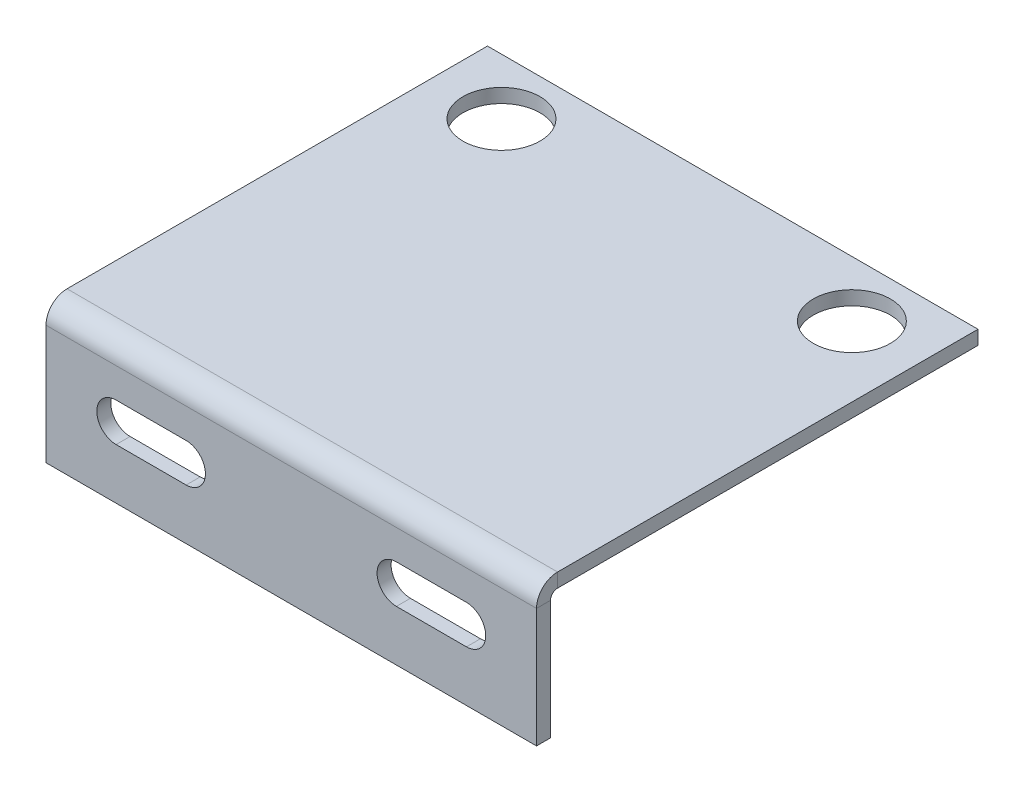
ISO-10303-21;
HEADER;
FILE_DESCRIPTION(('STEP AP214'),'2;1');
FILE_NAME('part.step','',(''),(''),'','','');
FILE_SCHEMA(('AUTOMOTIVE_DESIGN { 1 0 10303 214 1 1 1 1 }'));
ENDSEC;
DATA;
#1=APPLICATION_CONTEXT('core data for automotive mechanical design processes');
#2=APPLICATION_PROTOCOL_DEFINITION('international standard','automotive_design',2000,#1);
#3=PRODUCT_CONTEXT('',#1,'mechanical');
#4=PRODUCT('Part','Part','',(#3));
#5=PRODUCT_RELATED_PRODUCT_CATEGORY('part','',(#4));
#6=PRODUCT_DEFINITION_FORMATION('','',#4);
#7=PRODUCT_DEFINITION_CONTEXT('part definition',#1,'design');
#8=PRODUCT_DEFINITION('design','',#6,#7);
#9=PRODUCT_DEFINITION_SHAPE('','',#8);
#10=(LENGTH_UNIT() NAMED_UNIT(*) SI_UNIT(.MILLI.,.METRE.));
#11=(NAMED_UNIT(*) PLANE_ANGLE_UNIT() SI_UNIT($,.RADIAN.));
#12=(NAMED_UNIT(*) SI_UNIT($,.STERADIAN.) SOLID_ANGLE_UNIT());
#13=UNCERTAINTY_MEASURE_WITH_UNIT(LENGTH_MEASURE(1.E-05),#10,'distance_accuracy_value','');
#14=(GEOMETRIC_REPRESENTATION_CONTEXT(3) GLOBAL_UNCERTAINTY_ASSIGNED_CONTEXT((#13)) GLOBAL_UNIT_ASSIGNED_CONTEXT((#10,
#11,#12)) REPRESENTATION_CONTEXT('',''));
#15=CARTESIAN_POINT('',(0.,0.,0.));
#16=DIRECTION('',(0.,0.,1.));
#17=DIRECTION('',(1.,0.,0.));
#18=AXIS2_PLACEMENT_3D('',#15,#16,#17);
#19=CARTESIAN_POINT('',(0.,-2.,0.));
#20=DIRECTION('',(-1.,0.,0.));
#21=DIRECTION('',(0.,0.,1.));
#22=AXIS2_PLACEMENT_3D('',#19,#20,#21);
#23=PLANE('',#22);
#24=DIRECTION('',(0.,0.,1.));
#25=VECTOR('',#24,1.);
#26=CARTESIAN_POINT('',(0.,0.,0.));
#27=LINE('',#26,#25);
#28=CARTESIAN_POINT('',(0.,0.,-60.));
#29=VERTEX_POINT('',#28);
#30=CARTESIAN_POINT('',(0.,0.,0.));
#31=VERTEX_POINT('',#30);
#32=EDGE_CURVE('E275',#29,#31,#27,.T.);
#33=ORIENTED_EDGE('',*,*,#32,.F.);
#34=DIRECTION('',(0.,1.,0.));
#35=VECTOR('',#34,1.);
#36=CARTESIAN_POINT('',(0.,-2.,-60.));
#37=LINE('',#36,#35);
#38=CARTESIAN_POINT('',(0.,-2.,-60.));
#39=VERTEX_POINT('',#38);
#40=EDGE_CURVE('E13',#39,#29,#37,.T.);
#41=ORIENTED_EDGE('',*,*,#40,.F.);
#42=DIRECTION('',(0.,0.,1.));
#43=VECTOR('',#42,1.);
#44=CARTESIAN_POINT('',(0.,-2.,0.));
#45=LINE('',#44,#43);
#46=CARTESIAN_POINT('',(0.,-2.,0.));
#47=VERTEX_POINT('',#46);
#48=EDGE_CURVE('E284',#39,#47,#45,.T.);
#49=ORIENTED_EDGE('',*,*,#48,.T.);
#50=DIRECTION('',(0.,1.,0.));
#51=VECTOR('',#50,1.);
#52=CARTESIAN_POINT('',(0.,-2.,0.));
#53=LINE('',#52,#51);
#54=EDGE_CURVE('E60',#47,#31,#53,.T.);
#55=ORIENTED_EDGE('',*,*,#54,.T.);
#56=EDGE_LOOP('',(#33,#41,#49,#55));
#57=FACE_BOUND('',#56,.T.);
#58=ADVANCED_FACE('F57',(#57),#23,.T.);
#59=CARTESIAN_POINT('',(0.,-2.,-60.));
#60=DIRECTION('',(0.,0.,-1.));
#61=DIRECTION('',(-1.,0.,0.));
#62=AXIS2_PLACEMENT_3D('',#59,#60,#61);
#63=PLANE('',#62);
#64=DIRECTION('',(-1.,0.,0.));
#65=VECTOR('',#64,1.);
#66=CARTESIAN_POINT('',(0.,0.,-60.));
#67=LINE('',#66,#65);
#68=CARTESIAN_POINT('',(70.,0.,-60.));
#69=VERTEX_POINT('',#68);
#70=EDGE_CURVE('E288',#69,#29,#67,.T.);
#71=ORIENTED_EDGE('',*,*,#70,.F.);
#72=DIRECTION('',(0.,1.,0.));
#73=VECTOR('',#72,1.);
#74=CARTESIAN_POINT('',(70.,-2.,-60.));
#75=LINE('',#74,#73);
#76=CARTESIAN_POINT('',(70.,-2.,-60.));
#77=VERTEX_POINT('',#76);
#78=EDGE_CURVE('E65',#77,#69,#75,.T.);
#79=ORIENTED_EDGE('',*,*,#78,.F.);
#80=DIRECTION('',(-1.,0.,0.));
#81=VECTOR('',#80,1.);
#82=CARTESIAN_POINT('',(0.,-2.,-60.));
#83=LINE('',#82,#81);
#84=EDGE_CURVE('E293',#77,#39,#83,.T.);
#85=ORIENTED_EDGE('',*,*,#84,.T.);
#86=ORIENTED_EDGE('',*,*,#40,.T.);
#87=EDGE_LOOP('',(#71,#79,#85,#86));
#88=FACE_BOUND('',#87,.T.);
#89=ADVANCED_FACE('F322',(#88),#63,.T.);
#90=CARTESIAN_POINT('',(70.,-2.,0.));
#91=DIRECTION('',(1.,0.,0.));
#92=DIRECTION('',(0.,0.,-1.));
#93=AXIS2_PLACEMENT_3D('',#90,#91,#92);
#94=PLANE('',#93);
#95=DIRECTION('',(0.,0.,-1.));
#96=VECTOR('',#95,1.);
#97=CARTESIAN_POINT('',(70.,0.,0.));
#98=LINE('',#97,#96);
#99=CARTESIAN_POINT('',(70.,0.,0.));
#100=VERTEX_POINT('',#99);
#101=EDGE_CURVE('E301',#100,#69,#98,.T.);
#102=ORIENTED_EDGE('',*,*,#101,.F.);
#103=DIRECTION('',(0.,1.,0.));
#104=VECTOR('',#103,1.);
#105=CARTESIAN_POINT('',(70.,-2.,0.));
#106=LINE('',#105,#104);
#107=CARTESIAN_POINT('',(70.,-2.,0.));
#108=VERTEX_POINT('',#107);
#109=EDGE_CURVE('E306',#108,#100,#106,.T.);
#110=ORIENTED_EDGE('',*,*,#109,.F.);
#111=DIRECTION('',(0.,0.,-1.));
#112=VECTOR('',#111,1.);
#113=CARTESIAN_POINT('',(70.,-2.,0.));
#114=LINE('',#113,#112);
#115=EDGE_CURVE('E290',#108,#77,#114,.T.);
#116=ORIENTED_EDGE('',*,*,#115,.T.);
#117=ORIENTED_EDGE('',*,*,#78,.T.);
#118=EDGE_LOOP('',(#102,#110,#116,#117));
#119=FACE_BOUND('',#118,.T.);
#120=ADVANCED_FACE('F333',(#119),#94,.T.);
#121=CARTESIAN_POINT('',(0.,-2.,0.));
#122=DIRECTION('',(0.,-1.,0.));
#123=DIRECTION('',(0.,0.,-1.));
#124=AXIS2_PLACEMENT_3D('',#121,#122,#123);
#125=PLANE('',#124);
#126=CARTESIAN_POINT('',(60.,-2.,-52.));
#127=DIRECTION('',(0.,-1.,0.));
#128=DIRECTION('',(0.,0.,-1.));
#129=AXIS2_PLACEMENT_3D('',#126,#127,#128);
#130=CIRCLE('',#129,5.5);
#131=CARTESIAN_POINT('',(60.,-2.,-57.5));
#132=VERTEX_POINT('',#131);
#133=EDGE_CURVE('E205',#132,#132,#130,.T.);
#134=ORIENTED_EDGE('',*,*,#133,.F.);
#135=EDGE_LOOP('',(#134));
#136=FACE_BOUND('',#135,.T.);
#137=CARTESIAN_POINT('',(10.,-2.,-52.));
#138=DIRECTION('',(0.,-1.,0.));
#139=DIRECTION('',(0.,0.,-1.));
#140=AXIS2_PLACEMENT_3D('',#137,#138,#139);
#141=CIRCLE('',#140,5.5);
#142=CARTESIAN_POINT('',(10.,-2.,-57.5));
#143=VERTEX_POINT('',#142);
#144=EDGE_CURVE('E605',#143,#143,#141,.T.);
#145=ORIENTED_EDGE('',*,*,#144,.F.);
#146=EDGE_LOOP('',(#145));
#147=FACE_BOUND('',#146,.T.);
#148=ORIENTED_EDGE('',*,*,#48,.F.);
#149=ORIENTED_EDGE('',*,*,#84,.F.);
#150=ORIENTED_EDGE('',*,*,#115,.F.);
#151=DIRECTION('',(1.,0.,0.));
#152=VECTOR('',#151,1.);
#153=CARTESIAN_POINT('',(0.,-2.,0.));
#154=LINE('',#153,#152);
#155=EDGE_CURVE('E287',#47,#108,#154,.T.);
#156=ORIENTED_EDGE('',*,*,#155,.F.);
#157=EDGE_LOOP('',(#148,#149,#150,#156));
#158=FACE_BOUND('',#157,.T.);
#159=ADVANCED_FACE('F326',(#136,#147,#158),#125,.T.);
#160=CARTESIAN_POINT('',(0.,0.,0.));
#161=DIRECTION('',(0.,-1.,0.));
#162=DIRECTION('',(0.,0.,-1.));
#163=AXIS2_PLACEMENT_3D('',#160,#161,#162);
#164=PLANE('',#163);
#165=CARTESIAN_POINT('',(60.,0.,-52.));
#166=DIRECTION('',(0.,1.,0.));
#167=DIRECTION('',(0.,0.,1.));
#168=AXIS2_PLACEMENT_3D('',#165,#166,#167);
#169=CIRCLE('',#168,5.5);
#170=CARTESIAN_POINT('',(60.,0.,-46.5));
#171=VERTEX_POINT('',#170);
#172=EDGE_CURVE('E604',#171,#171,#169,.T.);
#173=ORIENTED_EDGE('',*,*,#172,.F.);
#174=EDGE_LOOP('',(#173));
#175=FACE_BOUND('',#174,.T.);
#176=CARTESIAN_POINT('',(10.,0.,-52.));
#177=DIRECTION('',(0.,1.,0.));
#178=DIRECTION('',(0.,0.,1.));
#179=AXIS2_PLACEMENT_3D('',#176,#177,#178);
#180=CIRCLE('',#179,5.5);
#181=CARTESIAN_POINT('',(10.,0.,-46.5));
#182=VERTEX_POINT('',#181);
#183=EDGE_CURVE('E606',#182,#182,#180,.T.);
#184=ORIENTED_EDGE('',*,*,#183,.F.);
#185=EDGE_LOOP('',(#184));
#186=FACE_BOUND('',#185,.T.);
#187=ORIENTED_EDGE('',*,*,#32,.T.);
#188=DIRECTION('',(1.,0.,0.));
#189=VECTOR('',#188,1.);
#190=CARTESIAN_POINT('',(0.,0.,0.));
#191=LINE('',#190,#189);
#192=EDGE_CURVE('E298',#31,#100,#191,.T.);
#193=ORIENTED_EDGE('',*,*,#192,.T.);
#194=ORIENTED_EDGE('',*,*,#101,.T.);
#195=ORIENTED_EDGE('',*,*,#70,.T.);
#196=EDGE_LOOP('',(#187,#193,#194,#195));
#197=FACE_BOUND('',#196,.T.);
#198=ADVANCED_FACE('F319',(#175,#186,#197),#164,.F.);
#199=CARTESIAN_POINT('',(70.,-3.,0.));
#200=DIRECTION('',(1.,0.,0.));
#201=DIRECTION('',(0.,0.,-1.));
#202=AXIS2_PLACEMENT_3D('',#199,#200,#201);
#203=PLANE('',#202);
#204=DIRECTION('',(0.,0.,-1.));
#205=VECTOR('',#204,1.);
#206=CARTESIAN_POINT('',(70.,-3.,3.));
#207=LINE('',#206,#205);
#208=CARTESIAN_POINT('',(70.,-2.99999999999999,1.));
#209=VERTEX_POINT('',#208);
#210=CARTESIAN_POINT('',(70.,-2.99999999999999,3.));
#211=VERTEX_POINT('',#210);
#212=EDGE_CURVE('E241',#209,#211,#207,.F.);
#213=ORIENTED_EDGE('',*,*,#212,.F.);
#214=CARTESIAN_POINT('',(70.,-3.,0.));
#215=DIRECTION('',(-1.,0.,0.));
#216=DIRECTION('',(0.,0.,1.));
#217=AXIS2_PLACEMENT_3D('',#214,#215,#216);
#218=CIRCLE('',#217,1.);
#219=EDGE_CURVE('E279',#108,#209,#218,.F.);
#220=ORIENTED_EDGE('',*,*,#219,.F.);
#221=ORIENTED_EDGE('',*,*,#109,.T.);
#222=CARTESIAN_POINT('',(70.,-3.,0.));
#223=DIRECTION('',(-1.,0.,0.));
#224=DIRECTION('',(0.,0.,1.));
#225=AXIS2_PLACEMENT_3D('',#222,#223,#224);
#226=CIRCLE('',#225,3.);
#227=EDGE_CURVE('E272',#100,#211,#226,.F.);
#228=ORIENTED_EDGE('',*,*,#227,.T.);
#229=EDGE_LOOP('',(#213,#220,#221,#228));
#230=FACE_BOUND('',#229,.T.);
#231=ADVANCED_FACE('F331',(#230),#203,.T.);
#232=CARTESIAN_POINT('',(0.,-3.,0.));
#233=DIRECTION('',(1.,0.,0.));
#234=DIRECTION('',(0.,0.,-1.));
#235=AXIS2_PLACEMENT_3D('',#232,#233,#234);
#236=PLANE('',#235);
#237=CARTESIAN_POINT('',(0.,-3.,0.));
#238=DIRECTION('',(-1.,0.,0.));
#239=DIRECTION('',(0.,0.,1.));
#240=AXIS2_PLACEMENT_3D('',#237,#238,#239);
#241=CIRCLE('',#240,1.);
#242=CARTESIAN_POINT('',(0.,-2.99999999999999,1.));
#243=VERTEX_POINT('',#242);
#244=EDGE_CURVE('E245',#243,#47,#241,.T.);
#245=ORIENTED_EDGE('',*,*,#244,.F.);
#246=DIRECTION('',(0.,0.,-1.));
#247=VECTOR('',#246,1.);
#248=CARTESIAN_POINT('',(0.,-3.,1.));
#249=LINE('',#248,#247);
#250=CARTESIAN_POINT('',(0.,-3.,3.));
#251=VERTEX_POINT('',#250);
#252=EDGE_CURVE('E265',#243,#251,#249,.F.);
#253=ORIENTED_EDGE('',*,*,#252,.T.);
#254=CARTESIAN_POINT('',(0.,-3.,0.));
#255=DIRECTION('',(-1.,0.,0.));
#256=DIRECTION('',(0.,0.,1.));
#257=AXIS2_PLACEMENT_3D('',#254,#255,#256);
#258=CIRCLE('',#257,3.);
#259=EDGE_CURVE('E276',#251,#31,#258,.T.);
#260=ORIENTED_EDGE('',*,*,#259,.T.);
#261=ORIENTED_EDGE('',*,*,#54,.F.);
#262=EDGE_LOOP('',(#245,#253,#260,#261));
#263=FACE_BOUND('',#262,.T.);
#264=ADVANCED_FACE('F390',(#263),#236,.F.);
#265=CARTESIAN_POINT('',(0.,-3.,0.));
#266=DIRECTION('',(-1.,0.,0.));
#267=DIRECTION('',(0.,0.,1.));
#268=AXIS2_PLACEMENT_3D('',#265,#266,#267);
#269=CYLINDRICAL_SURFACE('',#268,3.);
#270=ORIENTED_EDGE('',*,*,#192,.F.);
#271=ORIENTED_EDGE('',*,*,#259,.F.);
#272=DIRECTION('',(-1.,0.,0.));
#273=VECTOR('',#272,1.);
#274=CARTESIAN_POINT('',(70.,-3.,3.));
#275=LINE('',#274,#273);
#276=EDGE_CURVE('E263',#251,#211,#275,.F.);
#277=ORIENTED_EDGE('',*,*,#276,.T.);
#278=ORIENTED_EDGE('',*,*,#227,.F.);
#279=EDGE_LOOP('',(#270,#271,#277,#278));
#280=FACE_BOUND('',#279,.T.);
#281=ADVANCED_FACE('F400',(#280),#269,.T.);
#282=CARTESIAN_POINT('',(0.,-3.,0.));
#283=DIRECTION('',(-1.,0.,0.));
#284=DIRECTION('',(0.,0.,1.));
#285=AXIS2_PLACEMENT_3D('',#282,#283,#284);
#286=CYLINDRICAL_SURFACE('',#285,1.);
#287=ORIENTED_EDGE('',*,*,#155,.T.);
#288=ORIENTED_EDGE('',*,*,#219,.T.);
#289=DIRECTION('',(-1.,0.,0.));
#290=VECTOR('',#289,1.);
#291=CARTESIAN_POINT('',(70.,-3.,1.));
#292=LINE('',#291,#290);
#293=EDGE_CURVE('E268',#209,#243,#292,.T.);
#294=ORIENTED_EDGE('',*,*,#293,.T.);
#295=ORIENTED_EDGE('',*,*,#244,.T.);
#296=EDGE_LOOP('',(#287,#288,#294,#295));
#297=FACE_BOUND('',#296,.T.);
#298=ADVANCED_FACE('F329',(#297),#286,.F.);
#299=CARTESIAN_POINT('',(0.,-20.,3.00000000000006));
#300=DIRECTION('',(1.,0.,0.));
#301=DIRECTION('',(0.,0.,-1.));
#302=AXIS2_PLACEMENT_3D('',#299,#300,#301);
#303=PLANE('',#302);
#304=ORIENTED_EDGE('',*,*,#252,.F.);
#305=DIRECTION('',(0.,1.,0.));
#306=VECTOR('',#305,1.);
#307=CARTESIAN_POINT('',(0.,-20.,1.00000000000006));
#308=LINE('',#307,#306);
#309=CARTESIAN_POINT('',(0.,-20.,1.00000000000006));
#310=VERTEX_POINT('',#309);
#311=EDGE_CURVE('E261',#243,#310,#308,.F.);
#312=ORIENTED_EDGE('',*,*,#311,.T.);
#313=DIRECTION('',(0.,0.,-1.));
#314=VECTOR('',#313,1.);
#315=CARTESIAN_POINT('',(0.,-20.,3.00000000000006));
#316=LINE('',#315,#314);
#317=CARTESIAN_POINT('',(0.,-20.,3.00000000000006));
#318=VERTEX_POINT('',#317);
#319=EDGE_CURVE('E242',#318,#310,#316,.T.);
#320=ORIENTED_EDGE('',*,*,#319,.F.);
#321=DIRECTION('',(0.,-1.,0.));
#322=VECTOR('',#321,1.);
#323=CARTESIAN_POINT('',(0.,0.,2.99999999999999));
#324=LINE('',#323,#322);
#325=EDGE_CURVE('E254',#251,#318,#324,.T.);
#326=ORIENTED_EDGE('',*,*,#325,.F.);
#327=EDGE_LOOP('',(#304,#312,#320,#326));
#328=FACE_BOUND('',#327,.T.);
#329=ADVANCED_FACE('F420',(#328),#303,.F.);
#330=CARTESIAN_POINT('',(70.,-1.99999999999999,3.));
#331=DIRECTION('',(-1.,0.,0.));
#332=DIRECTION('',(0.,0.,1.));
#333=AXIS2_PLACEMENT_3D('',#330,#331,#332);
#334=PLANE('',#333);
#335=ORIENTED_EDGE('',*,*,#212,.T.);
#336=DIRECTION('',(0.,1.,0.));
#337=VECTOR('',#336,1.);
#338=CARTESIAN_POINT('',(70.,0.,2.99999999999999));
#339=LINE('',#338,#337);
#340=CARTESIAN_POINT('',(70.,-20.,3.00000000000006));
#341=VERTEX_POINT('',#340);
#342=EDGE_CURVE('E249',#341,#211,#339,.T.);
#343=ORIENTED_EDGE('',*,*,#342,.F.);
#344=DIRECTION('',(0.,0.,-1.));
#345=VECTOR('',#344,1.);
#346=CARTESIAN_POINT('',(70.,-20.,3.00000000000006));
#347=LINE('',#346,#345);
#348=CARTESIAN_POINT('',(70.,-20.,1.00000000000006));
#349=VERTEX_POINT('',#348);
#350=EDGE_CURVE('E246',#341,#349,#347,.T.);
#351=ORIENTED_EDGE('',*,*,#350,.T.);
#352=DIRECTION('',(0.,-1.,0.));
#353=VECTOR('',#352,1.);
#354=CARTESIAN_POINT('',(70.,-2.,0.999999999999997));
#355=LINE('',#354,#353);
#356=EDGE_CURVE('E256',#349,#209,#355,.F.);
#357=ORIENTED_EDGE('',*,*,#356,.T.);
#358=EDGE_LOOP('',(#335,#343,#351,#357));
#359=FACE_BOUND('',#358,.T.);
#360=ADVANCED_FACE('F430',(#359),#334,.F.);
#361=CARTESIAN_POINT('',(0.,0.,2.99999999999999));
#362=DIRECTION('',(0.,0.,-1.));
#363=DIRECTION('',(0.,1.,0.));
#364=AXIS2_PLACEMENT_3D('',#361,#362,#363);
#365=PLANE('',#364);
#366=DIRECTION('',(1.,0.,0.));
#367=VECTOR('',#366,1.);
#368=CARTESIAN_POINT('',(0.,-7.25,3.00000000000001));
#369=LINE('',#368,#367);
#370=CARTESIAN_POINT('',(50.,-7.25,3.00000000000001));
#371=VERTEX_POINT('',#370);
#372=CARTESIAN_POINT('',(60.,-7.25000000000001,3.00000000000001));
#373=VERTEX_POINT('',#372);
#374=EDGE_CURVE('E235',#371,#373,#369,.T.);
#375=ORIENTED_EDGE('',*,*,#374,.T.);
#376=CARTESIAN_POINT('',(60.,-10.,3.00000000000003));
#377=DIRECTION('',(0.,0.,-1.));
#378=DIRECTION('',(0.,1.,0.));
#379=AXIS2_PLACEMENT_3D('',#376,#377,#378);
#380=CIRCLE('',#379,2.75);
#381=CARTESIAN_POINT('',(60.,-12.75,3.00000000000003));
#382=VERTEX_POINT('',#381);
#383=EDGE_CURVE('E238',#373,#382,#380,.T.);
#384=ORIENTED_EDGE('',*,*,#383,.T.);
#385=DIRECTION('',(-1.,0.,0.));
#386=VECTOR('',#385,1.);
#387=CARTESIAN_POINT('',(0.,-12.75,3.00000000000003));
#388=LINE('',#387,#386);
#389=CARTESIAN_POINT('',(50.,-12.75,3.00000000000003));
#390=VERTEX_POINT('',#389);
#391=EDGE_CURVE('E232',#382,#390,#388,.T.);
#392=ORIENTED_EDGE('',*,*,#391,.T.);
#393=CARTESIAN_POINT('',(50.,-10.,3.00000000000003));
#394=DIRECTION('',(0.,0.,-1.));
#395=DIRECTION('',(0.,1.,0.));
#396=AXIS2_PLACEMENT_3D('',#393,#394,#395);
#397=CIRCLE('',#396,2.75);
#398=EDGE_CURVE('E175',#390,#371,#397,.T.);
#399=ORIENTED_EDGE('',*,*,#398,.T.);
#400=EDGE_LOOP('',(#375,#384,#392,#399));
#401=FACE_BOUND('',#400,.T.);
#402=DIRECTION('',(-1.,0.,0.));
#403=VECTOR('',#402,1.);
#404=CARTESIAN_POINT('',(0.,-12.75,3.00000000000003));
#405=LINE('',#404,#403);
#406=CARTESIAN_POINT('',(20.,-12.75,3.00000000000002));
#407=VERTEX_POINT('',#406);
#408=CARTESIAN_POINT('',(10.,-12.75,3.00000000000003));
#409=VERTEX_POINT('',#408);
#410=EDGE_CURVE('E226',#407,#409,#405,.T.);
#411=ORIENTED_EDGE('',*,*,#410,.T.);
#412=CARTESIAN_POINT('',(10.,-10.,3.00000000000003));
#413=DIRECTION('',(0.,0.,-1.));
#414=DIRECTION('',(0.,1.,0.));
#415=AXIS2_PLACEMENT_3D('',#412,#413,#414);
#416=CIRCLE('',#415,2.75);
#417=CARTESIAN_POINT('',(10.,-7.25000000000001,3.00000000000001));
#418=VERTEX_POINT('',#417);
#419=EDGE_CURVE('E229',#409,#418,#416,.T.);
#420=ORIENTED_EDGE('',*,*,#419,.T.);
#421=DIRECTION('',(1.,0.,0.));
#422=VECTOR('',#421,1.);
#423=CARTESIAN_POINT('',(0.,-7.25000000000001,3.00000000000001));
#424=LINE('',#423,#422);
#425=CARTESIAN_POINT('',(20.,-7.25,3.00000000000001));
#426=VERTEX_POINT('',#425);
#427=EDGE_CURVE('E199',#418,#426,#424,.T.);
#428=ORIENTED_EDGE('',*,*,#427,.T.);
#429=CARTESIAN_POINT('',(20.,-10.,3.00000000000003));
#430=DIRECTION('',(0.,0.,-1.));
#431=DIRECTION('',(0.,1.,0.));
#432=AXIS2_PLACEMENT_3D('',#429,#430,#431);
#433=CIRCLE('',#432,2.75);
#434=EDGE_CURVE('E223',#426,#407,#433,.T.);
#435=ORIENTED_EDGE('',*,*,#434,.T.);
#436=EDGE_LOOP('',(#411,#420,#428,#435));
#437=FACE_BOUND('',#436,.T.);
#438=ORIENTED_EDGE('',*,*,#276,.F.);
#439=ORIENTED_EDGE('',*,*,#325,.T.);
#440=DIRECTION('',(1.,0.,0.));
#441=VECTOR('',#440,1.);
#442=CARTESIAN_POINT('',(0.,-20.,3.00000000000006));
#443=LINE('',#442,#441);
#444=EDGE_CURVE('E252',#318,#341,#443,.T.);
#445=ORIENTED_EDGE('',*,*,#444,.T.);
#446=ORIENTED_EDGE('',*,*,#342,.T.);
#447=EDGE_LOOP('',(#438,#439,#445,#446));
#448=FACE_BOUND('',#447,.T.);
#449=ADVANCED_FACE('F441',(#401,#437,#448),#365,.F.);
#450=CARTESIAN_POINT('',(0.,0.,0.99999999999999));
#451=DIRECTION('',(0.,0.,-1.));
#452=DIRECTION('',(0.,1.,0.));
#453=AXIS2_PLACEMENT_3D('',#450,#451,#452);
#454=PLANE('',#453);
#455=CARTESIAN_POINT('',(60.,-10.,1.00000000000002));
#456=DIRECTION('',(0.,0.,-1.));
#457=DIRECTION('',(0.,1.,0.));
#458=AXIS2_PLACEMENT_3D('',#455,#456,#457);
#459=CIRCLE('',#458,2.75);
#460=CARTESIAN_POINT('',(60.,-7.25000000000001,1.00000000000001));
#461=VERTEX_POINT('',#460);
#462=CARTESIAN_POINT('',(60.,-12.75,1.00000000000003));
#463=VERTEX_POINT('',#462);
#464=EDGE_CURVE('E187',#461,#463,#459,.T.);
#465=ORIENTED_EDGE('',*,*,#464,.F.);
#466=DIRECTION('',(1.,0.,0.));
#467=VECTOR('',#466,1.);
#468=CARTESIAN_POINT('',(60.,-7.25000000000001,1.00000000000001));
#469=LINE('',#468,#467);
#470=CARTESIAN_POINT('',(50.,-7.25000000000001,1.00000000000001));
#471=VERTEX_POINT('',#470);
#472=EDGE_CURVE('E192',#471,#461,#469,.T.);
#473=ORIENTED_EDGE('',*,*,#472,.F.);
#474=CARTESIAN_POINT('',(50.,-10.,1.00000000000002));
#475=DIRECTION('',(0.,0.,-1.));
#476=DIRECTION('',(0.,1.,0.));
#477=AXIS2_PLACEMENT_3D('',#474,#475,#476);
#478=CIRCLE('',#477,2.75);
#479=CARTESIAN_POINT('',(50.,-12.75,1.00000000000003));
#480=VERTEX_POINT('',#479);
#481=EDGE_CURVE('E172',#480,#471,#478,.T.);
#482=ORIENTED_EDGE('',*,*,#481,.F.);
#483=DIRECTION('',(-1.,0.,0.));
#484=VECTOR('',#483,1.);
#485=CARTESIAN_POINT('',(60.,-12.75,1.00000000000003));
#486=LINE('',#485,#484);
#487=EDGE_CURVE('E182',#463,#480,#486,.T.);
#488=ORIENTED_EDGE('',*,*,#487,.F.);
#489=EDGE_LOOP('',(#465,#473,#482,#488));
#490=FACE_BOUND('',#489,.T.);
#491=CARTESIAN_POINT('',(10.,-10.,1.00000000000002));
#492=DIRECTION('',(0.,0.,-1.));
#493=DIRECTION('',(0.,-1.,0.));
#494=AXIS2_PLACEMENT_3D('',#491,#492,#493);
#495=CIRCLE('',#494,2.75);
#496=CARTESIAN_POINT('',(10.,-12.75,1.00000000000003));
#497=VERTEX_POINT('',#496);
#498=CARTESIAN_POINT('',(10.,-7.25000000000001,1.00000000000001));
#499=VERTEX_POINT('',#498);
#500=EDGE_CURVE('E202',#497,#499,#495,.T.);
#501=ORIENTED_EDGE('',*,*,#500,.F.);
#502=DIRECTION('',(-1.,0.,0.));
#503=VECTOR('',#502,1.);
#504=CARTESIAN_POINT('',(10.,-12.75,1.00000000000003));
#505=LINE('',#504,#503);
#506=CARTESIAN_POINT('',(20.,-12.75,1.00000000000003));
#507=VERTEX_POINT('',#506);
#508=EDGE_CURVE('E210',#507,#497,#505,.T.);
#509=ORIENTED_EDGE('',*,*,#508,.F.);
#510=CARTESIAN_POINT('',(20.,-10.,1.00000000000002));
#511=DIRECTION('',(0.,0.,-1.));
#512=DIRECTION('',(0.,-1.,0.));
#513=AXIS2_PLACEMENT_3D('',#510,#511,#512);
#514=CIRCLE('',#513,2.75);
#515=CARTESIAN_POINT('',(20.,-7.25000000000001,1.00000000000001));
#516=VERTEX_POINT('',#515);
#517=EDGE_CURVE('E207',#516,#507,#514,.T.);
#518=ORIENTED_EDGE('',*,*,#517,.F.);
#519=DIRECTION('',(1.,0.,0.));
#520=VECTOR('',#519,1.);
#521=CARTESIAN_POINT('',(10.,-7.25000000000001,1.00000000000001));
#522=LINE('',#521,#520);
#523=EDGE_CURVE('E204',#499,#516,#522,.T.);
#524=ORIENTED_EDGE('',*,*,#523,.F.);
#525=EDGE_LOOP('',(#501,#509,#518,#524));
#526=FACE_BOUND('',#525,.T.);
#527=ORIENTED_EDGE('',*,*,#311,.F.);
#528=ORIENTED_EDGE('',*,*,#293,.F.);
#529=ORIENTED_EDGE('',*,*,#356,.F.);
#530=DIRECTION('',(-1.,0.,0.));
#531=VECTOR('',#530,1.);
#532=CARTESIAN_POINT('',(70.,-20.,1.00000000000006));
#533=LINE('',#532,#531);
#534=EDGE_CURVE('E259',#310,#349,#533,.F.);
#535=ORIENTED_EDGE('',*,*,#534,.F.);
#536=EDGE_LOOP('',(#527,#528,#529,#535));
#537=FACE_BOUND('',#536,.T.);
#538=ADVANCED_FACE('F189',(#490,#526,#537),#454,.T.);
#539=CARTESIAN_POINT('',(70.,-20.,3.00000000000006));
#540=DIRECTION('',(0.,1.,0.));
#541=DIRECTION('',(0.,0.,1.));
#542=AXIS2_PLACEMENT_3D('',#539,#540,#541);
#543=PLANE('',#542);
#544=ORIENTED_EDGE('',*,*,#534,.T.);
#545=ORIENTED_EDGE('',*,*,#350,.F.);
#546=ORIENTED_EDGE('',*,*,#444,.F.);
#547=ORIENTED_EDGE('',*,*,#319,.T.);
#548=EDGE_LOOP('',(#544,#545,#546,#547));
#549=FACE_BOUND('',#548,.T.);
#550=ADVANCED_FACE('F463',(#549),#543,.F.);
#551=CARTESIAN_POINT('',(10.,-9.99999999999998,11.));
#552=DIRECTION('',(0.,0.,-1.));
#553=DIRECTION('',(0.,1.,0.));
#554=AXIS2_PLACEMENT_3D('',#551,#552,#553);
#555=CYLINDRICAL_SURFACE('',#554,2.75);
#556=DIRECTION('',(0.,0.,-1.));
#557=VECTOR('',#556,1.);
#558=CARTESIAN_POINT('',(10.,-12.75,11.));
#559=LINE('',#558,#557);
#560=EDGE_CURVE('E214',#409,#497,#559,.T.);
#561=ORIENTED_EDGE('',*,*,#560,.T.);
#562=ORIENTED_EDGE('',*,*,#500,.T.);
#563=DIRECTION('',(0.,0.,-1.));
#564=VECTOR('',#563,1.);
#565=CARTESIAN_POINT('',(10.,-7.24999999999998,11.));
#566=LINE('',#565,#564);
#567=EDGE_CURVE('E213',#418,#499,#566,.T.);
#568=ORIENTED_EDGE('',*,*,#567,.F.);
#569=ORIENTED_EDGE('',*,*,#419,.F.);
#570=EDGE_LOOP('',(#561,#562,#568,#569));
#571=FACE_BOUND('',#570,.T.);
#572=ADVANCED_FACE('F473',(#571),#555,.F.);
#573=CARTESIAN_POINT('',(10.,-12.75,11.));
#574=DIRECTION('',(0.,-1.,0.));
#575=DIRECTION('',(0.,0.,-1.));
#576=AXIS2_PLACEMENT_3D('',#573,#574,#575);
#577=PLANE('',#576);
#578=DIRECTION('',(0.,0.,-1.));
#579=VECTOR('',#578,1.);
#580=CARTESIAN_POINT('',(20.,-12.75,11.));
#581=LINE('',#580,#579);
#582=EDGE_CURVE('E216',#407,#507,#581,.T.);
#583=ORIENTED_EDGE('',*,*,#582,.T.);
#584=ORIENTED_EDGE('',*,*,#508,.T.);
#585=ORIENTED_EDGE('',*,*,#560,.F.);
#586=ORIENTED_EDGE('',*,*,#410,.F.);
#587=EDGE_LOOP('',(#583,#584,#585,#586));
#588=FACE_BOUND('',#587,.T.);
#589=ADVANCED_FACE('F483',(#588),#577,.F.);
#590=CARTESIAN_POINT('',(20.,-9.99999999999998,11.));
#591=DIRECTION('',(0.,0.,-1.));
#592=DIRECTION('',(0.,1.,0.));
#593=AXIS2_PLACEMENT_3D('',#590,#591,#592);
#594=CYLINDRICAL_SURFACE('',#593,2.75);
#595=DIRECTION('',(0.,0.,-1.));
#596=VECTOR('',#595,1.);
#597=CARTESIAN_POINT('',(20.,-7.24999999999998,11.));
#598=LINE('',#597,#596);
#599=EDGE_CURVE('E81',#426,#516,#598,.T.);
#600=ORIENTED_EDGE('',*,*,#599,.T.);
#601=ORIENTED_EDGE('',*,*,#517,.T.);
#602=ORIENTED_EDGE('',*,*,#582,.F.);
#603=ORIENTED_EDGE('',*,*,#434,.F.);
#604=EDGE_LOOP('',(#600,#601,#602,#603));
#605=FACE_BOUND('',#604,.T.);
#606=ADVANCED_FACE('F494',(#605),#594,.F.);
#607=CARTESIAN_POINT('',(10.,-7.24999999999998,11.));
#608=DIRECTION('',(0.,1.,0.));
#609=DIRECTION('',(0.,0.,1.));
#610=AXIS2_PLACEMENT_3D('',#607,#608,#609);
#611=PLANE('',#610);
#612=ORIENTED_EDGE('',*,*,#567,.T.);
#613=ORIENTED_EDGE('',*,*,#523,.T.);
#614=ORIENTED_EDGE('',*,*,#599,.F.);
#615=ORIENTED_EDGE('',*,*,#427,.F.);
#616=EDGE_LOOP('',(#612,#613,#614,#615));
#617=FACE_BOUND('',#616,.T.);
#618=ADVANCED_FACE('F505',(#617),#611,.F.);
#619=CARTESIAN_POINT('',(60.,-9.99999999999998,11.));
#620=DIRECTION('',(0.,0.,-1.));
#621=DIRECTION('',(0.,1.,0.));
#622=AXIS2_PLACEMENT_3D('',#619,#620,#621);
#623=CYLINDRICAL_SURFACE('',#622,2.75);
#624=DIRECTION('',(0.,0.,-1.));
#625=VECTOR('',#624,1.);
#626=CARTESIAN_POINT('',(60.,-7.24999999999998,11.));
#627=LINE('',#626,#625);
#628=EDGE_CURVE('E197',#373,#461,#627,.T.);
#629=ORIENTED_EDGE('',*,*,#628,.T.);
#630=ORIENTED_EDGE('',*,*,#464,.T.);
#631=DIRECTION('',(0.,0.,-1.));
#632=VECTOR('',#631,1.);
#633=CARTESIAN_POINT('',(60.,-12.75,11.));
#634=LINE('',#633,#632);
#635=EDGE_CURVE('E178',#382,#463,#634,.T.);
#636=ORIENTED_EDGE('',*,*,#635,.F.);
#637=ORIENTED_EDGE('',*,*,#383,.F.);
#638=EDGE_LOOP('',(#629,#630,#636,#637));
#639=FACE_BOUND('',#638,.T.);
#640=ADVANCED_FACE('F516',(#639),#623,.F.);
#641=CARTESIAN_POINT('',(60.,-7.24999999999998,11.));
#642=DIRECTION('',(0.,1.,0.));
#643=DIRECTION('',(0.,0.,1.));
#644=AXIS2_PLACEMENT_3D('',#641,#642,#643);
#645=PLANE('',#644);
#646=DIRECTION('',(0.,0.,-1.));
#647=VECTOR('',#646,1.);
#648=CARTESIAN_POINT('',(50.,-7.24999999999998,11.));
#649=LINE('',#648,#647);
#650=EDGE_CURVE('E177',#371,#471,#649,.T.);
#651=ORIENTED_EDGE('',*,*,#650,.T.);
#652=ORIENTED_EDGE('',*,*,#472,.T.);
#653=ORIENTED_EDGE('',*,*,#628,.F.);
#654=ORIENTED_EDGE('',*,*,#374,.F.);
#655=EDGE_LOOP('',(#651,#652,#653,#654));
#656=FACE_BOUND('',#655,.T.);
#657=ADVANCED_FACE('F526',(#656),#645,.F.);
#658=CARTESIAN_POINT('',(50.,-9.99999999999998,11.));
#659=DIRECTION('',(0.,0.,-1.));
#660=DIRECTION('',(0.,1.,0.));
#661=AXIS2_PLACEMENT_3D('',#658,#659,#660);
#662=CYLINDRICAL_SURFACE('',#661,2.75);
#663=DIRECTION('',(0.,0.,-1.));
#664=VECTOR('',#663,1.);
#665=CARTESIAN_POINT('',(50.,-12.75,11.));
#666=LINE('',#665,#664);
#667=EDGE_CURVE('E73',#390,#480,#666,.T.);
#668=ORIENTED_EDGE('',*,*,#667,.T.);
#669=ORIENTED_EDGE('',*,*,#481,.T.);
#670=ORIENTED_EDGE('',*,*,#650,.F.);
#671=ORIENTED_EDGE('',*,*,#398,.F.);
#672=EDGE_LOOP('',(#668,#669,#670,#671));
#673=FACE_BOUND('',#672,.T.);
#674=ADVANCED_FACE('F169',(#673),#662,.F.);
#675=CARTESIAN_POINT('',(60.,-12.75,11.));
#676=DIRECTION('',(0.,-1.,0.));
#677=DIRECTION('',(0.,0.,-1.));
#678=AXIS2_PLACEMENT_3D('',#675,#676,#677);
#679=PLANE('',#678);
#680=ORIENTED_EDGE('',*,*,#635,.T.);
#681=ORIENTED_EDGE('',*,*,#487,.T.);
#682=ORIENTED_EDGE('',*,*,#667,.F.);
#683=ORIENTED_EDGE('',*,*,#391,.F.);
#684=EDGE_LOOP('',(#680,#681,#682,#683));
#685=FACE_BOUND('',#684,.T.);
#686=ADVANCED_FACE('F183',(#685),#679,.F.);
#687=CARTESIAN_POINT('',(10.,-10.,-52.));
#688=DIRECTION('',(0.,1.,0.));
#689=DIRECTION('',(0.,0.,1.));
#690=AXIS2_PLACEMENT_3D('',#687,#688,#689);
#691=CYLINDRICAL_SURFACE('',#690,5.5);
#692=ORIENTED_EDGE('',*,*,#144,.T.);
#693=EDGE_LOOP('',(#692));
#694=FACE_BOUND('',#693,.T.);
#695=ORIENTED_EDGE('',*,*,#183,.T.);
#696=EDGE_LOOP('',(#695));
#697=FACE_BOUND('',#696,.T.);
#698=ADVANCED_FACE('F555',(#694,#697),#691,.F.);
#699=CARTESIAN_POINT('',(60.,-10.,-52.));
#700=DIRECTION('',(0.,1.,0.));
#701=DIRECTION('',(0.,0.,1.));
#702=AXIS2_PLACEMENT_3D('',#699,#700,#701);
#703=CYLINDRICAL_SURFACE('',#702,5.5);
#704=ORIENTED_EDGE('',*,*,#133,.T.);
#705=EDGE_LOOP('',(#704));
#706=FACE_BOUND('',#705,.T.);
#707=ORIENTED_EDGE('',*,*,#172,.T.);
#708=EDGE_LOOP('',(#707));
#709=FACE_BOUND('',#708,.T.);
#710=ADVANCED_FACE('F564',(#706,#709),#703,.F.);
#711=CLOSED_SHELL('',(#58,#89,#120,#159,#198,#231,#264,#281,#298,#329,#360,#449,#538,#550,#572,
#589,#606,#618,#640,#657,#674,#686,#698,#710));
#712=MANIFOLD_SOLID_BREP('B2',#711);
#713=ADVANCED_BREP_SHAPE_REPRESENTATION('',(#18,#712),#14);
#714=SHAPE_DEFINITION_REPRESENTATION(#9,#713);
ENDSEC;
END-ISO-10303-21;
